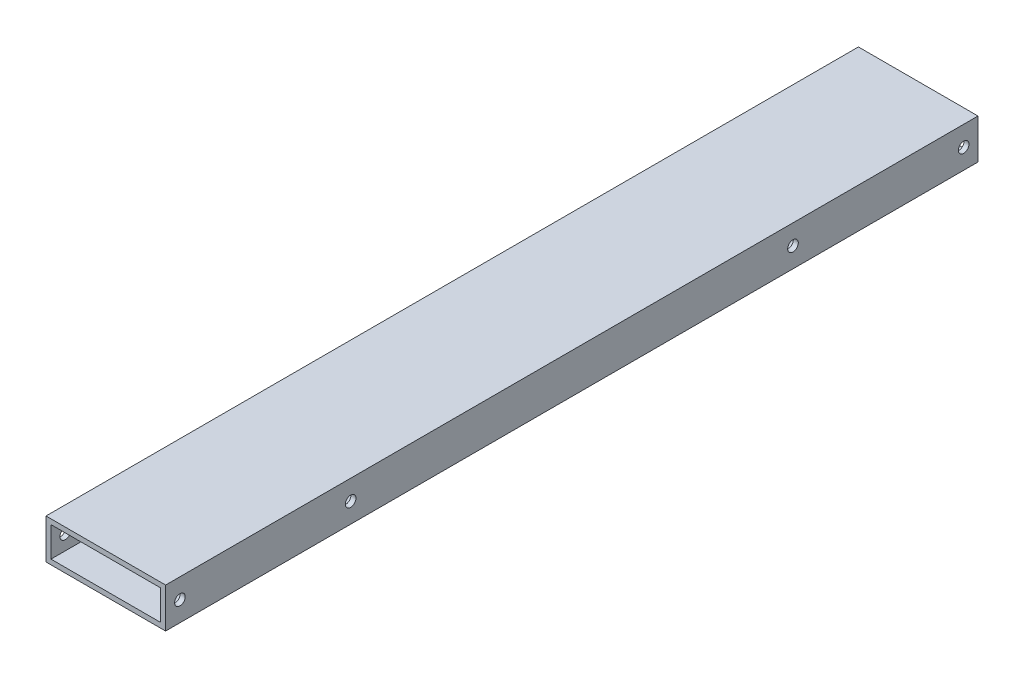
ISO-10303-21;
HEADER;
FILE_DESCRIPTION(('STEP AP214'),'2;1');
FILE_NAME('part.step','',(''),(''),'','','');
FILE_SCHEMA(('AUTOMOTIVE_DESIGN { 1 0 10303 214 1 1 1 1 }'));
ENDSEC;
DATA;
#1=APPLICATION_CONTEXT('core data for automotive mechanical design processes');
#2=APPLICATION_PROTOCOL_DEFINITION('international standard','automotive_design',2000,#1);
#3=PRODUCT_CONTEXT('',#1,'mechanical');
#4=PRODUCT('Part','Part','',(#3));
#5=PRODUCT_RELATED_PRODUCT_CATEGORY('part','',(#4));
#6=PRODUCT_DEFINITION_FORMATION('','',#4);
#7=PRODUCT_DEFINITION_CONTEXT('part definition',#1,'design');
#8=PRODUCT_DEFINITION('design','',#6,#7);
#9=PRODUCT_DEFINITION_SHAPE('','',#8);
#10=(LENGTH_UNIT() NAMED_UNIT(*) SI_UNIT(.MILLI.,.METRE.));
#11=(NAMED_UNIT(*) PLANE_ANGLE_UNIT() SI_UNIT($,.RADIAN.));
#12=(NAMED_UNIT(*) SI_UNIT($,.STERADIAN.) SOLID_ANGLE_UNIT());
#13=UNCERTAINTY_MEASURE_WITH_UNIT(LENGTH_MEASURE(1.E-05),#10,'distance_accuracy_value','');
#14=(GEOMETRIC_REPRESENTATION_CONTEXT(3) GLOBAL_UNCERTAINTY_ASSIGNED_CONTEXT((#13)) GLOBAL_UNIT_ASSIGNED_CONTEXT((#10,
#11,#12)) REPRESENTATION_CONTEXT('',''));
#15=CARTESIAN_POINT('',(0.,0.,0.));
#16=DIRECTION('',(0.,0.,1.));
#17=DIRECTION('',(1.,0.,0.));
#18=AXIS2_PLACEMENT_3D('',#15,#16,#17);
#19=CARTESIAN_POINT('',(0.,0.,517.525));
#20=DIRECTION('',(0.,0.,-1.));
#21=DIRECTION('',(-1.,0.,0.));
#22=AXIS2_PLACEMENT_3D('',#19,#20,#21);
#23=PLANE('',#22);
#24=DIRECTION('',(0.,-1.,0.));
#25=VECTOR('',#24,1.);
#26=CARTESIAN_POINT('',(0.,0.,517.525));
#27=LINE('',#26,#25);
#28=CARTESIAN_POINT('',(0.,25.4,517.525));
#29=VERTEX_POINT('',#28);
#30=CARTESIAN_POINT('',(0.,0.,517.525));
#31=VERTEX_POINT('',#30);
#32=EDGE_CURVE('E139',#29,#31,#27,.T.);
#33=ORIENTED_EDGE('',*,*,#32,.T.);
#34=DIRECTION('',(1.,0.,0.));
#35=VECTOR('',#34,1.);
#36=CARTESIAN_POINT('',(0.,0.,517.525));
#37=LINE('',#36,#35);
#38=CARTESIAN_POINT('',(76.2,0.,517.525));
#39=VERTEX_POINT('',#38);
#40=EDGE_CURVE('E142',#31,#39,#37,.T.);
#41=ORIENTED_EDGE('',*,*,#40,.T.);
#42=DIRECTION('',(0.,1.,0.));
#43=VECTOR('',#42,1.);
#44=CARTESIAN_POINT('',(76.2,0.,517.525));
#45=LINE('',#44,#43);
#46=CARTESIAN_POINT('',(76.2,25.4,517.525));
#47=VERTEX_POINT('',#46);
#48=EDGE_CURVE('E145',#39,#47,#45,.T.);
#49=ORIENTED_EDGE('',*,*,#48,.T.);
#50=DIRECTION('',(-1.,0.,0.));
#51=VECTOR('',#50,1.);
#52=CARTESIAN_POINT('',(0.,25.4,517.525));
#53=LINE('',#52,#51);
#54=EDGE_CURVE('E147',#47,#29,#53,.T.);
#55=ORIENTED_EDGE('',*,*,#54,.T.);
#56=EDGE_LOOP('',(#33,#41,#49,#55));
#57=FACE_BOUND('',#56,.T.);
#58=DIRECTION('',(0.,-1.,0.));
#59=VECTOR('',#58,1.);
#60=CARTESIAN_POINT('',(3.175,3.175,517.525));
#61=LINE('',#60,#59);
#62=CARTESIAN_POINT('',(3.175,22.225,517.525));
#63=VERTEX_POINT('',#62);
#64=CARTESIAN_POINT('',(3.175,3.175,517.525));
#65=VERTEX_POINT('',#64);
#66=EDGE_CURVE('E101',#63,#65,#61,.T.);
#67=ORIENTED_EDGE('',*,*,#66,.F.);
#68=DIRECTION('',(-1.,0.,0.));
#69=VECTOR('',#68,1.);
#70=CARTESIAN_POINT('',(3.175,22.225,517.525));
#71=LINE('',#70,#69);
#72=CARTESIAN_POINT('',(73.025,22.225,517.525));
#73=VERTEX_POINT('',#72);
#74=EDGE_CURVE('E123',#73,#63,#71,.T.);
#75=ORIENTED_EDGE('',*,*,#74,.F.);
#76=DIRECTION('',(0.,1.,0.));
#77=VECTOR('',#76,1.);
#78=CARTESIAN_POINT('',(73.025,3.175,517.525));
#79=LINE('',#78,#77);
#80=CARTESIAN_POINT('',(73.025,3.175,517.525));
#81=VERTEX_POINT('',#80);
#82=EDGE_CURVE('E121',#81,#73,#79,.T.);
#83=ORIENTED_EDGE('',*,*,#82,.F.);
#84=DIRECTION('',(1.,0.,0.));
#85=VECTOR('',#84,1.);
#86=CARTESIAN_POINT('',(3.175,3.175,517.525));
#87=LINE('',#86,#85);
#88=EDGE_CURVE('E109',#65,#81,#87,.T.);
#89=ORIENTED_EDGE('',*,*,#88,.F.);
#90=EDGE_LOOP('',(#67,#75,#83,#89));
#91=FACE_BOUND('',#90,.T.);
#92=ADVANCED_FACE('F34',(#57,#91),#23,.F.);
#93=CARTESIAN_POINT('',(0.,0.,0.));
#94=DIRECTION('',(0.,0.,-1.));
#95=DIRECTION('',(-1.,0.,0.));
#96=AXIS2_PLACEMENT_3D('',#93,#94,#95);
#97=PLANE('',#96);
#98=DIRECTION('',(0.,-1.,0.));
#99=VECTOR('',#98,1.);
#100=CARTESIAN_POINT('',(0.,0.,0.));
#101=LINE('',#100,#99);
#102=CARTESIAN_POINT('',(0.,25.4,0.));
#103=VERTEX_POINT('',#102);
#104=CARTESIAN_POINT('',(0.,0.,0.));
#105=VERTEX_POINT('',#104);
#106=EDGE_CURVE('E117',#103,#105,#101,.T.);
#107=ORIENTED_EDGE('',*,*,#106,.F.);
#108=DIRECTION('',(-1.,0.,0.));
#109=VECTOR('',#108,1.);
#110=CARTESIAN_POINT('',(0.,25.4,0.));
#111=LINE('',#110,#109);
#112=CARTESIAN_POINT('',(76.2,25.4,0.));
#113=VERTEX_POINT('',#112);
#114=EDGE_CURVE('E143',#113,#103,#111,.T.);
#115=ORIENTED_EDGE('',*,*,#114,.F.);
#116=DIRECTION('',(0.,1.,0.));
#117=VECTOR('',#116,1.);
#118=CARTESIAN_POINT('',(76.2,0.,0.));
#119=LINE('',#118,#117);
#120=CARTESIAN_POINT('',(76.2,0.,0.));
#121=VERTEX_POINT('',#120);
#122=EDGE_CURVE('E154',#121,#113,#119,.T.);
#123=ORIENTED_EDGE('',*,*,#122,.F.);
#124=DIRECTION('',(1.,0.,0.));
#125=VECTOR('',#124,1.);
#126=CARTESIAN_POINT('',(0.,0.,0.));
#127=LINE('',#126,#125);
#128=EDGE_CURVE('E152',#105,#121,#127,.T.);
#129=ORIENTED_EDGE('',*,*,#128,.F.);
#130=EDGE_LOOP('',(#107,#115,#123,#129));
#131=FACE_BOUND('',#130,.T.);
#132=DIRECTION('',(-1.,0.,0.));
#133=VECTOR('',#132,1.);
#134=CARTESIAN_POINT('',(3.175,22.225,0.));
#135=LINE('',#134,#133);
#136=CARTESIAN_POINT('',(73.025,22.225,0.));
#137=VERTEX_POINT('',#136);
#138=CARTESIAN_POINT('',(3.175,22.225,0.));
#139=VERTEX_POINT('',#138);
#140=EDGE_CURVE('E110',#137,#139,#135,.T.);
#141=ORIENTED_EDGE('',*,*,#140,.T.);
#142=DIRECTION('',(0.,-1.,0.));
#143=VECTOR('',#142,1.);
#144=CARTESIAN_POINT('',(3.175,3.175,0.));
#145=LINE('',#144,#143);
#146=CARTESIAN_POINT('',(3.175,3.175,0.));
#147=VERTEX_POINT('',#146);
#148=EDGE_CURVE('E59',#139,#147,#145,.T.);
#149=ORIENTED_EDGE('',*,*,#148,.T.);
#150=DIRECTION('',(1.,0.,0.));
#151=VECTOR('',#150,1.);
#152=CARTESIAN_POINT('',(3.175,3.175,0.));
#153=LINE('',#152,#151);
#154=CARTESIAN_POINT('',(73.025,3.175,0.));
#155=VERTEX_POINT('',#154);
#156=EDGE_CURVE('E116',#147,#155,#153,.T.);
#157=ORIENTED_EDGE('',*,*,#156,.T.);
#158=DIRECTION('',(0.,1.,0.));
#159=VECTOR('',#158,1.);
#160=CARTESIAN_POINT('',(73.025,3.175,0.));
#161=LINE('',#160,#159);
#162=EDGE_CURVE('E131',#155,#137,#161,.T.);
#163=ORIENTED_EDGE('',*,*,#162,.T.);
#164=EDGE_LOOP('',(#141,#149,#157,#163));
#165=FACE_BOUND('',#164,.T.);
#166=ADVANCED_FACE('F225',(#131,#165),#97,.T.);
#167=CARTESIAN_POINT('',(0.,0.,517.525));
#168=DIRECTION('',(1.,0.,0.));
#169=DIRECTION('',(0.,1.,0.));
#170=AXIS2_PLACEMENT_3D('',#167,#168,#169);
#171=PLANE('',#170);
#172=CARTESIAN_POINT('',(0.,12.7000000000003,117.8687));
#173=DIRECTION('',(-1.,0.,0.));
#174=DIRECTION('',(0.,0.,1.));
#175=AXIS2_PLACEMENT_3D('',#172,#173,#174);
#176=CIRCLE('',#175,3.37819999999999);
#177=CARTESIAN_POINT('',(0.,12.7000000000003,121.2469));
#178=VERTEX_POINT('',#177);
#179=EDGE_CURVE('E295',#178,#178,#176,.T.);
#180=ORIENTED_EDGE('',*,*,#179,.F.);
#181=EDGE_LOOP('',(#180));
#182=FACE_BOUND('',#181,.T.);
#183=CARTESIAN_POINT('',(0.,12.7000000000003,9.13129999999995));
#184=DIRECTION('',(-1.,0.,0.));
#185=DIRECTION('',(0.,0.,1.));
#186=AXIS2_PLACEMENT_3D('',#183,#184,#185);
#187=CIRCLE('',#186,3.37819999999884);
#188=CARTESIAN_POINT('',(0.,12.7000000000003,12.5094999999988));
#189=VERTEX_POINT('',#188);
#190=EDGE_CURVE('E175',#189,#189,#187,.T.);
#191=ORIENTED_EDGE('',*,*,#190,.F.);
#192=EDGE_LOOP('',(#191));
#193=FACE_BOUND('',#192,.T.);
#194=CARTESIAN_POINT('',(0.,12.7000000000003,399.6563));
#195=DIRECTION('',(1.,0.,0.));
#196=DIRECTION('',(0.,0.,-1.));
#197=AXIS2_PLACEMENT_3D('',#194,#195,#196);
#198=CIRCLE('',#197,3.37819999999999);
#199=CARTESIAN_POINT('',(0.,12.7000000000003,396.2781));
#200=VERTEX_POINT('',#199);
#201=EDGE_CURVE('E171',#200,#200,#198,.T.);
#202=ORIENTED_EDGE('',*,*,#201,.T.);
#203=EDGE_LOOP('',(#202));
#204=FACE_BOUND('',#203,.T.);
#205=CARTESIAN_POINT('',(0.,12.7000000000003,508.3937));
#206=DIRECTION('',(1.,0.,0.));
#207=DIRECTION('',(0.,0.,-1.));
#208=AXIS2_PLACEMENT_3D('',#205,#206,#207);
#209=CIRCLE('',#208,3.37819999999884);
#210=CARTESIAN_POINT('',(0.,12.7000000000003,505.015500000001));
#211=VERTEX_POINT('',#210);
#212=EDGE_CURVE('E167',#211,#211,#209,.T.);
#213=ORIENTED_EDGE('',*,*,#212,.T.);
#214=EDGE_LOOP('',(#213));
#215=FACE_BOUND('',#214,.T.);
#216=ORIENTED_EDGE('',*,*,#106,.T.);
#217=DIRECTION('',(0.,0.,-1.));
#218=VECTOR('',#217,1.);
#219=CARTESIAN_POINT('',(0.,0.,517.525));
#220=LINE('',#219,#218);
#221=EDGE_CURVE('E11',#31,#105,#220,.T.);
#222=ORIENTED_EDGE('',*,*,#221,.F.);
#223=ORIENTED_EDGE('',*,*,#32,.F.);
#224=DIRECTION('',(0.,0.,-1.));
#225=VECTOR('',#224,1.);
#226=CARTESIAN_POINT('',(0.,25.4,517.525));
#227=LINE('',#226,#225);
#228=EDGE_CURVE('E149',#29,#103,#227,.T.);
#229=ORIENTED_EDGE('',*,*,#228,.T.);
#230=EDGE_LOOP('',(#216,#222,#223,#229));
#231=FACE_BOUND('',#230,.T.);
#232=ADVANCED_FACE('F36',(#182,#193,#204,#215,#231),#171,.F.);
#233=CARTESIAN_POINT('',(0.,0.,517.525));
#234=DIRECTION('',(0.,1.,0.));
#235=DIRECTION('',(0.,0.,1.));
#236=AXIS2_PLACEMENT_3D('',#233,#234,#235);
#237=PLANE('',#236);
#238=ORIENTED_EDGE('',*,*,#128,.T.);
#239=DIRECTION('',(0.,0.,-1.));
#240=VECTOR('',#239,1.);
#241=CARTESIAN_POINT('',(76.2,0.,517.525));
#242=LINE('',#241,#240);
#243=EDGE_CURVE('E43',#39,#121,#242,.T.);
#244=ORIENTED_EDGE('',*,*,#243,.F.);
#245=ORIENTED_EDGE('',*,*,#40,.F.);
#246=ORIENTED_EDGE('',*,*,#221,.T.);
#247=EDGE_LOOP('',(#238,#244,#245,#246));
#248=FACE_BOUND('',#247,.T.);
#249=ADVANCED_FACE('F234',(#248),#237,.F.);
#250=CARTESIAN_POINT('',(76.2,0.,517.525));
#251=DIRECTION('',(-1.,0.,0.));
#252=DIRECTION('',(0.,0.,1.));
#253=AXIS2_PLACEMENT_3D('',#250,#251,#252);
#254=PLANE('',#253);
#255=CARTESIAN_POINT('',(76.2,12.7000000000003,117.8687));
#256=DIRECTION('',(-1.,0.,0.));
#257=DIRECTION('',(0.,0.,1.));
#258=AXIS2_PLACEMENT_3D('',#255,#256,#257);
#259=CIRCLE('',#258,3.37819999999999);
#260=CARTESIAN_POINT('',(76.2,12.7000000000003,121.2469));
#261=VERTEX_POINT('',#260);
#262=EDGE_CURVE('E294',#261,#261,#259,.T.);
#263=ORIENTED_EDGE('',*,*,#262,.T.);
#264=EDGE_LOOP('',(#263));
#265=FACE_BOUND('',#264,.T.);
#266=CARTESIAN_POINT('',(76.2,12.7000000000003,9.13129999999995));
#267=DIRECTION('',(-1.,0.,0.));
#268=DIRECTION('',(0.,0.,1.));
#269=AXIS2_PLACEMENT_3D('',#266,#267,#268);
#270=CIRCLE('',#269,3.37819999999884);
#271=CARTESIAN_POINT('',(76.2,12.7000000000003,12.5094999999988));
#272=VERTEX_POINT('',#271);
#273=EDGE_CURVE('E182',#272,#272,#270,.T.);
#274=ORIENTED_EDGE('',*,*,#273,.T.);
#275=EDGE_LOOP('',(#274));
#276=FACE_BOUND('',#275,.T.);
#277=CARTESIAN_POINT('',(76.2,12.7000000000003,399.6563));
#278=DIRECTION('',(1.,0.,0.));
#279=DIRECTION('',(0.,0.,-1.));
#280=AXIS2_PLACEMENT_3D('',#277,#278,#279);
#281=CIRCLE('',#280,3.37819999999999);
#282=CARTESIAN_POINT('',(76.2,12.7000000000003,396.2781));
#283=VERTEX_POINT('',#282);
#284=EDGE_CURVE('E179',#283,#283,#281,.T.);
#285=ORIENTED_EDGE('',*,*,#284,.F.);
#286=EDGE_LOOP('',(#285));
#287=FACE_BOUND('',#286,.T.);
#288=CARTESIAN_POINT('',(76.2,12.7000000000003,508.3937));
#289=DIRECTION('',(1.,0.,0.));
#290=DIRECTION('',(0.,0.,-1.));
#291=AXIS2_PLACEMENT_3D('',#288,#289,#290);
#292=CIRCLE('',#291,3.37819999999884);
#293=CARTESIAN_POINT('',(76.2,12.7000000000003,505.015500000001));
#294=VERTEX_POINT('',#293);
#295=EDGE_CURVE('E198',#294,#294,#292,.T.);
#296=ORIENTED_EDGE('',*,*,#295,.F.);
#297=EDGE_LOOP('',(#296));
#298=FACE_BOUND('',#297,.T.);
#299=ORIENTED_EDGE('',*,*,#122,.T.);
#300=DIRECTION('',(0.,0.,-1.));
#301=VECTOR('',#300,1.);
#302=CARTESIAN_POINT('',(76.2,25.4,517.525));
#303=LINE('',#302,#301);
#304=EDGE_CURVE('E159',#47,#113,#303,.T.);
#305=ORIENTED_EDGE('',*,*,#304,.F.);
#306=ORIENTED_EDGE('',*,*,#48,.F.);
#307=ORIENTED_EDGE('',*,*,#243,.T.);
#308=EDGE_LOOP('',(#299,#305,#306,#307));
#309=FACE_BOUND('',#308,.T.);
#310=ADVANCED_FACE('F218',(#265,#276,#287,#298,#309),#254,.F.);
#311=CARTESIAN_POINT('',(0.,25.4,517.525));
#312=DIRECTION('',(0.,-1.,0.));
#313=DIRECTION('',(0.,0.,-1.));
#314=AXIS2_PLACEMENT_3D('',#311,#312,#313);
#315=PLANE('',#314);
#316=ORIENTED_EDGE('',*,*,#114,.T.);
#317=ORIENTED_EDGE('',*,*,#228,.F.);
#318=ORIENTED_EDGE('',*,*,#54,.F.);
#319=ORIENTED_EDGE('',*,*,#304,.T.);
#320=EDGE_LOOP('',(#316,#317,#318,#319));
#321=FACE_BOUND('',#320,.T.);
#322=ADVANCED_FACE('F209',(#321),#315,.F.);
#323=CARTESIAN_POINT('',(3.175,3.175,517.525));
#324=DIRECTION('',(1.,0.,0.));
#325=DIRECTION('',(0.,0.,-1.));
#326=AXIS2_PLACEMENT_3D('',#323,#324,#325);
#327=PLANE('',#326);
#328=CARTESIAN_POINT('',(3.175,12.7000000000003,117.8687));
#329=DIRECTION('',(1.,0.,0.));
#330=DIRECTION('',(0.,0.,-1.));
#331=AXIS2_PLACEMENT_3D('',#328,#329,#330);
#332=CIRCLE('',#331,3.37819999999999);
#333=CARTESIAN_POINT('',(3.175,12.7000000000003,114.4905));
#334=VERTEX_POINT('',#333);
#335=EDGE_CURVE('E187',#334,#334,#332,.F.);
#336=ORIENTED_EDGE('',*,*,#335,.T.);
#337=EDGE_LOOP('',(#336));
#338=FACE_BOUND('',#337,.T.);
#339=CARTESIAN_POINT('',(3.175,12.7000000000003,9.13129999999995));
#340=DIRECTION('',(1.,0.,0.));
#341=DIRECTION('',(0.,0.,-1.));
#342=AXIS2_PLACEMENT_3D('',#339,#340,#341);
#343=CIRCLE('',#342,3.37819999999884);
#344=CARTESIAN_POINT('',(3.175,12.7000000000003,5.75310000000112));
#345=VERTEX_POINT('',#344);
#346=EDGE_CURVE('E174',#345,#345,#343,.F.);
#347=ORIENTED_EDGE('',*,*,#346,.T.);
#348=EDGE_LOOP('',(#347));
#349=FACE_BOUND('',#348,.T.);
#350=CARTESIAN_POINT('',(3.175,12.7000000000003,399.6563));
#351=DIRECTION('',(1.,0.,0.));
#352=DIRECTION('',(0.,0.,-1.));
#353=AXIS2_PLACEMENT_3D('',#350,#351,#352);
#354=CIRCLE('',#353,3.37819999999999);
#355=CARTESIAN_POINT('',(3.175,12.7000000000003,396.2781));
#356=VERTEX_POINT('',#355);
#357=EDGE_CURVE('E170',#356,#356,#354,.T.);
#358=ORIENTED_EDGE('',*,*,#357,.F.);
#359=EDGE_LOOP('',(#358));
#360=FACE_BOUND('',#359,.T.);
#361=CARTESIAN_POINT('',(3.175,12.7000000000003,508.3937));
#362=DIRECTION('',(1.,0.,0.));
#363=DIRECTION('',(0.,0.,-1.));
#364=AXIS2_PLACEMENT_3D('',#361,#362,#363);
#365=CIRCLE('',#364,3.37819999999884);
#366=CARTESIAN_POINT('',(3.175,12.7000000000003,505.015500000001));
#367=VERTEX_POINT('',#366);
#368=EDGE_CURVE('E129',#367,#367,#365,.T.);
#369=ORIENTED_EDGE('',*,*,#368,.F.);
#370=EDGE_LOOP('',(#369));
#371=FACE_BOUND('',#370,.T.);
#372=ORIENTED_EDGE('',*,*,#148,.F.);
#373=DIRECTION('',(0.,0.,-1.));
#374=VECTOR('',#373,1.);
#375=CARTESIAN_POINT('',(3.175,22.225,517.525));
#376=LINE('',#375,#374);
#377=EDGE_CURVE('E105',#63,#139,#376,.T.);
#378=ORIENTED_EDGE('',*,*,#377,.F.);
#379=ORIENTED_EDGE('',*,*,#66,.T.);
#380=DIRECTION('',(0.,0.,-1.));
#381=VECTOR('',#380,1.);
#382=CARTESIAN_POINT('',(3.175,3.175,517.525));
#383=LINE('',#382,#381);
#384=EDGE_CURVE('E104',#65,#147,#383,.T.);
#385=ORIENTED_EDGE('',*,*,#384,.T.);
#386=EDGE_LOOP('',(#372,#378,#379,#385));
#387=FACE_BOUND('',#386,.T.);
#388=ADVANCED_FACE('F103',(#338,#349,#360,#371,#387),#327,.T.);
#389=CARTESIAN_POINT('',(3.175,3.175,517.525));
#390=DIRECTION('',(0.,1.,0.));
#391=DIRECTION('',(0.,0.,1.));
#392=AXIS2_PLACEMENT_3D('',#389,#390,#391);
#393=PLANE('',#392);
#394=ORIENTED_EDGE('',*,*,#156,.F.);
#395=ORIENTED_EDGE('',*,*,#384,.F.);
#396=ORIENTED_EDGE('',*,*,#88,.T.);
#397=DIRECTION('',(0.,0.,-1.));
#398=VECTOR('',#397,1.);
#399=CARTESIAN_POINT('',(73.025,3.175,517.525));
#400=LINE('',#399,#398);
#401=EDGE_CURVE('E118',#81,#155,#400,.T.);
#402=ORIENTED_EDGE('',*,*,#401,.T.);
#403=EDGE_LOOP('',(#394,#395,#396,#402));
#404=FACE_BOUND('',#403,.T.);
#405=ADVANCED_FACE('F113',(#404),#393,.T.);
#406=CARTESIAN_POINT('',(73.025,3.175,517.525));
#407=DIRECTION('',(-1.,0.,0.));
#408=DIRECTION('',(0.,0.,1.));
#409=AXIS2_PLACEMENT_3D('',#406,#407,#408);
#410=PLANE('',#409);
#411=CARTESIAN_POINT('',(73.025,12.7000000000003,117.8687));
#412=DIRECTION('',(-1.,0.,0.));
#413=DIRECTION('',(0.,0.,1.));
#414=AXIS2_PLACEMENT_3D('',#411,#412,#413);
#415=CIRCLE('',#414,3.37819999999999);
#416=CARTESIAN_POINT('',(73.025,12.7000000000003,121.2469));
#417=VERTEX_POINT('',#416);
#418=EDGE_CURVE('E38',#417,#417,#415,.F.);
#419=ORIENTED_EDGE('',*,*,#418,.T.);
#420=EDGE_LOOP('',(#419));
#421=FACE_BOUND('',#420,.T.);
#422=CARTESIAN_POINT('',(73.025,12.7000000000003,9.13129999999995));
#423=DIRECTION('',(-1.,0.,0.));
#424=DIRECTION('',(0.,0.,1.));
#425=AXIS2_PLACEMENT_3D('',#422,#423,#424);
#426=CIRCLE('',#425,3.37819999999884);
#427=CARTESIAN_POINT('',(73.025,12.7000000000003,12.5094999999988));
#428=VERTEX_POINT('',#427);
#429=EDGE_CURVE('E172',#428,#428,#426,.F.);
#430=ORIENTED_EDGE('',*,*,#429,.T.);
#431=EDGE_LOOP('',(#430));
#432=FACE_BOUND('',#431,.T.);
#433=CARTESIAN_POINT('',(73.025,12.7000000000003,399.6563));
#434=DIRECTION('',(-1.,0.,0.));
#435=DIRECTION('',(0.,0.,1.));
#436=AXIS2_PLACEMENT_3D('',#433,#434,#435);
#437=CIRCLE('',#436,3.37819999999999);
#438=CARTESIAN_POINT('',(73.025,12.7000000000003,403.0345));
#439=VERTEX_POINT('',#438);
#440=EDGE_CURVE('E168',#439,#439,#437,.T.);
#441=ORIENTED_EDGE('',*,*,#440,.F.);
#442=EDGE_LOOP('',(#441));
#443=FACE_BOUND('',#442,.T.);
#444=CARTESIAN_POINT('',(73.025,12.7000000000003,508.3937));
#445=DIRECTION('',(-1.,0.,0.));
#446=DIRECTION('',(0.,0.,1.));
#447=AXIS2_PLACEMENT_3D('',#444,#445,#446);
#448=CIRCLE('',#447,3.37819999999884);
#449=CARTESIAN_POINT('',(73.025,12.7000000000003,511.771899999999));
#450=VERTEX_POINT('',#449);
#451=EDGE_CURVE('E164',#450,#450,#448,.T.);
#452=ORIENTED_EDGE('',*,*,#451,.F.);
#453=EDGE_LOOP('',(#452));
#454=FACE_BOUND('',#453,.T.);
#455=ORIENTED_EDGE('',*,*,#162,.F.);
#456=ORIENTED_EDGE('',*,*,#401,.F.);
#457=ORIENTED_EDGE('',*,*,#82,.T.);
#458=DIRECTION('',(0.,0.,-1.));
#459=VECTOR('',#458,1.);
#460=CARTESIAN_POINT('',(73.025,22.225,517.525));
#461=LINE('',#460,#459);
#462=EDGE_CURVE('E51',#73,#137,#461,.T.);
#463=ORIENTED_EDGE('',*,*,#462,.T.);
#464=EDGE_LOOP('',(#455,#456,#457,#463));
#465=FACE_BOUND('',#464,.T.);
#466=ADVANCED_FACE('F216',(#421,#432,#443,#454,#465),#410,.T.);
#467=CARTESIAN_POINT('',(3.175,22.225,517.525));
#468=DIRECTION('',(0.,-1.,0.));
#469=DIRECTION('',(0.,0.,-1.));
#470=AXIS2_PLACEMENT_3D('',#467,#468,#469);
#471=PLANE('',#470);
#472=ORIENTED_EDGE('',*,*,#140,.F.);
#473=ORIENTED_EDGE('',*,*,#462,.F.);
#474=ORIENTED_EDGE('',*,*,#74,.T.);
#475=ORIENTED_EDGE('',*,*,#377,.T.);
#476=EDGE_LOOP('',(#472,#473,#474,#475));
#477=FACE_BOUND('',#476,.T.);
#478=ADVANCED_FACE('F256',(#477),#471,.T.);
#479=CARTESIAN_POINT('',(0.,12.7000000000003,508.3937));
#480=DIRECTION('',(1.,0.,0.));
#481=DIRECTION('',(0.,0.,-1.));
#482=AXIS2_PLACEMENT_3D('',#479,#480,#481);
#483=CYLINDRICAL_SURFACE('',#482,3.37819999999884);
#484=ORIENTED_EDGE('',*,*,#451,.T.);
#485=EDGE_LOOP('',(#484));
#486=FACE_BOUND('',#485,.T.);
#487=ORIENTED_EDGE('',*,*,#295,.T.);
#488=EDGE_LOOP('',(#487));
#489=FACE_BOUND('',#488,.T.);
#490=ADVANCED_FACE('F258',(#486,#489),#483,.F.);
#491=ORIENTED_EDGE('',*,*,#368,.T.);
#492=EDGE_LOOP('',(#491));
#493=FACE_BOUND('',#492,.T.);
#494=ORIENTED_EDGE('',*,*,#212,.F.);
#495=EDGE_LOOP('',(#494));
#496=FACE_BOUND('',#495,.T.);
#497=ADVANCED_FACE('F205',(#493,#496),#483,.F.);
#498=CARTESIAN_POINT('',(0.,12.7000000000003,399.6563));
#499=DIRECTION('',(1.,0.,0.));
#500=DIRECTION('',(0.,0.,-1.));
#501=AXIS2_PLACEMENT_3D('',#498,#499,#500);
#502=CYLINDRICAL_SURFACE('',#501,3.37819999999999);
#503=ORIENTED_EDGE('',*,*,#440,.T.);
#504=EDGE_LOOP('',(#503));
#505=FACE_BOUND('',#504,.T.);
#506=ORIENTED_EDGE('',*,*,#284,.T.);
#507=EDGE_LOOP('',(#506));
#508=FACE_BOUND('',#507,.T.);
#509=ADVANCED_FACE('F269',(#505,#508),#502,.F.);
#510=ORIENTED_EDGE('',*,*,#357,.T.);
#511=EDGE_LOOP('',(#510));
#512=FACE_BOUND('',#511,.T.);
#513=ORIENTED_EDGE('',*,*,#201,.F.);
#514=EDGE_LOOP('',(#513));
#515=FACE_BOUND('',#514,.T.);
#516=ADVANCED_FACE('F272',(#512,#515),#502,.F.);
#517=CARTESIAN_POINT('',(0.,12.7000000000003,9.13129999999995));
#518=DIRECTION('',(1.,0.,0.));
#519=DIRECTION('',(0.,0.,-1.));
#520=AXIS2_PLACEMENT_3D('',#517,#518,#519);
#521=CYLINDRICAL_SURFACE('',#520,3.37819999999884);
#522=ORIENTED_EDGE('',*,*,#429,.F.);
#523=EDGE_LOOP('',(#522));
#524=FACE_BOUND('',#523,.T.);
#525=ORIENTED_EDGE('',*,*,#273,.F.);
#526=EDGE_LOOP('',(#525));
#527=FACE_BOUND('',#526,.T.);
#528=ADVANCED_FACE('F274',(#524,#527),#521,.F.);
#529=ORIENTED_EDGE('',*,*,#346,.F.);
#530=EDGE_LOOP('',(#529));
#531=FACE_BOUND('',#530,.T.);
#532=ORIENTED_EDGE('',*,*,#190,.T.);
#533=EDGE_LOOP('',(#532));
#534=FACE_BOUND('',#533,.T.);
#535=ADVANCED_FACE('F277',(#531,#534),#521,.F.);
#536=CARTESIAN_POINT('',(0.,12.7000000000003,117.8687));
#537=DIRECTION('',(1.,0.,0.));
#538=DIRECTION('',(0.,0.,-1.));
#539=AXIS2_PLACEMENT_3D('',#536,#537,#538);
#540=CYLINDRICAL_SURFACE('',#539,3.37819999999999);
#541=ORIENTED_EDGE('',*,*,#418,.F.);
#542=EDGE_LOOP('',(#541));
#543=FACE_BOUND('',#542,.T.);
#544=ORIENTED_EDGE('',*,*,#262,.F.);
#545=EDGE_LOOP('',(#544));
#546=FACE_BOUND('',#545,.T.);
#547=ADVANCED_FACE('F279',(#543,#546),#540,.F.);
#548=ORIENTED_EDGE('',*,*,#335,.F.);
#549=EDGE_LOOP('',(#548));
#550=FACE_BOUND('',#549,.T.);
#551=ORIENTED_EDGE('',*,*,#179,.T.);
#552=EDGE_LOOP('',(#551));
#553=FACE_BOUND('',#552,.T.);
#554=ADVANCED_FACE('F281',(#550,#553),#540,.F.);
#555=CLOSED_SHELL('',(#92,#166,#232,#249,#310,#322,#388,#405,#466,#478,#490,#497,#509,#516,#528,
#535,#547,#554));
#556=MANIFOLD_SOLID_BREP('B2',#555);
#557=ADVANCED_BREP_SHAPE_REPRESENTATION('',(#18,#556),#14);
#558=SHAPE_DEFINITION_REPRESENTATION(#9,#557);
ENDSEC;
END-ISO-10303-21;
